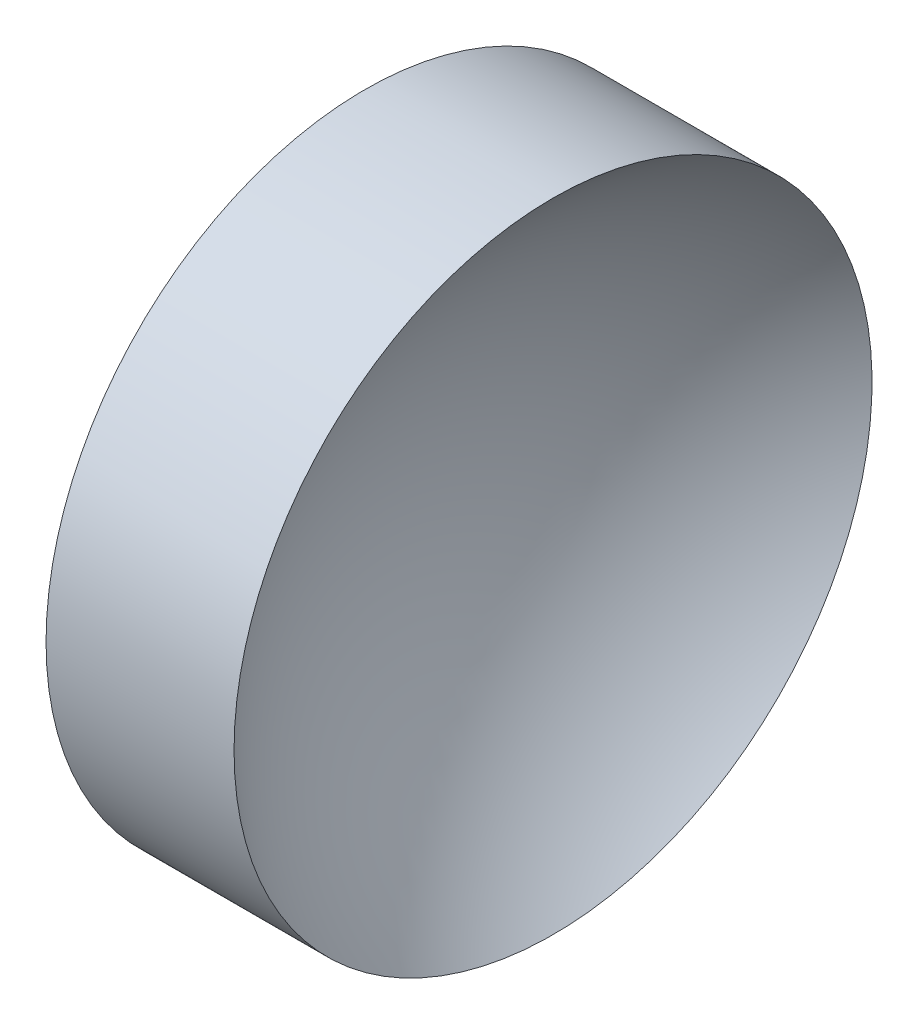
ISO-10303-21;
HEADER;
FILE_DESCRIPTION(('STEP AP214'),'2;1');
FILE_NAME('part.step','',(''),(''),'','','');
FILE_SCHEMA(('AUTOMOTIVE_DESIGN { 1 0 10303 214 1 1 1 1 }'));
ENDSEC;
DATA;
#1=APPLICATION_CONTEXT('core data for automotive mechanical design processes');
#2=APPLICATION_PROTOCOL_DEFINITION('international standard','automotive_design',2000,#1);
#3=PRODUCT_CONTEXT('',#1,'mechanical');
#4=PRODUCT('Part','Part','',(#3));
#5=PRODUCT_RELATED_PRODUCT_CATEGORY('part','',(#4));
#6=PRODUCT_DEFINITION_FORMATION('','',#4);
#7=PRODUCT_DEFINITION_CONTEXT('part definition',#1,'design');
#8=PRODUCT_DEFINITION('design','',#6,#7);
#9=PRODUCT_DEFINITION_SHAPE('','',#8);
#10=(LENGTH_UNIT() NAMED_UNIT(*) SI_UNIT(.MILLI.,.METRE.));
#11=(NAMED_UNIT(*) PLANE_ANGLE_UNIT() SI_UNIT($,.RADIAN.));
#12=(NAMED_UNIT(*) SI_UNIT($,.STERADIAN.) SOLID_ANGLE_UNIT());
#13=UNCERTAINTY_MEASURE_WITH_UNIT(LENGTH_MEASURE(1.E-05),#10,'distance_accuracy_value','');
#14=(GEOMETRIC_REPRESENTATION_CONTEXT(3) GLOBAL_UNCERTAINTY_ASSIGNED_CONTEXT((#13)) GLOBAL_UNIT_ASSIGNED_CONTEXT((#10,
#11,#12)) REPRESENTATION_CONTEXT('',''));
#15=CARTESIAN_POINT('',(0.,0.,0.));
#16=DIRECTION('',(0.,0.,1.));
#17=DIRECTION('',(1.,0.,0.));
#18=AXIS2_PLACEMENT_3D('',#15,#16,#17);
#19=CARTESIAN_POINT('',(149.239437134643,65.1556304570152,0.));
#20=DIRECTION('',(-1.,0.,0.));
#21=DIRECTION('',(0.,1.,0.));
#22=AXIS2_PLACEMENT_3D('',#19,#20,#21);
#23=SPHERICAL_SURFACE('',#22,32.5);
#24=CARTESIAN_POINT('',(128.472877477348,65.1556304570152,0.));
#25=DIRECTION('',(-1.,0.,0.));
#26=DIRECTION('',(0.,0.,1.));
#27=AXIS2_PLACEMENT_3D('',#24,#25,#26);
#28=CIRCLE('',#27,25.);
#29=CARTESIAN_POINT('',(128.472877477348,65.1556304570152,25.));
#30=VERTEX_POINT('',#29);
#31=EDGE_CURVE('E10',#30,#30,#28,.T.);
#32=ORIENTED_EDGE('',*,*,#31,.F.);
#33=EDGE_LOOP('',(#32));
#34=FACE_BOUND('',#33,.T.);
#35=ADVANCED_FACE('F35',(#34),#23,.F.);
#36=CARTESIAN_POINT('',(105.62183712383,65.1556304570152,0.));
#37=DIRECTION('',(-1.,0.,0.));
#38=DIRECTION('',(0.,0.,1.));
#39=AXIS2_PLACEMENT_3D('',#36,#37,#38);
#40=CYLINDRICAL_SURFACE('',#39,25.);
#41=CARTESIAN_POINT('',(113.739437134643,65.1556304570152,0.));
#42=DIRECTION('',(-1.,0.,0.));
#43=DIRECTION('',(0.,0.,1.));
#44=AXIS2_PLACEMENT_3D('',#41,#42,#43);
#45=CIRCLE('',#44,25.);
#46=CARTESIAN_POINT('',(113.739437134643,65.1556304570152,25.));
#47=VERTEX_POINT('',#46);
#48=EDGE_CURVE('E41',#47,#47,#45,.T.);
#49=ORIENTED_EDGE('',*,*,#48,.F.);
#50=EDGE_LOOP('',(#49));
#51=FACE_BOUND('',#50,.T.);
#52=ORIENTED_EDGE('',*,*,#31,.T.);
#53=EDGE_LOOP('',(#52));
#54=FACE_BOUND('',#53,.T.);
#55=ADVANCED_FACE('F49',(#51,#54),#40,.T.);
#56=CARTESIAN_POINT('',(113.739437134643,65.1556304570152,0.));
#57=DIRECTION('',(1.,0.,0.));
#58=DIRECTION('',(0.,0.,-1.));
#59=AXIS2_PLACEMENT_3D('',#56,#57,#58);
#60=PLANE('',#59);
#61=ORIENTED_EDGE('',*,*,#48,.T.);
#62=EDGE_LOOP('',(#61));
#63=FACE_BOUND('',#62,.T.);
#64=ADVANCED_FACE('F47',(#63),#60,.F.);
#65=CLOSED_SHELL('',(#35,#55,#64));
#66=MANIFOLD_SOLID_BREP('B2',#65);
#67=ADVANCED_BREP_SHAPE_REPRESENTATION('',(#18,#66),#14);
#68=SHAPE_DEFINITION_REPRESENTATION(#9,#67);
ENDSEC;
END-ISO-10303-21;
